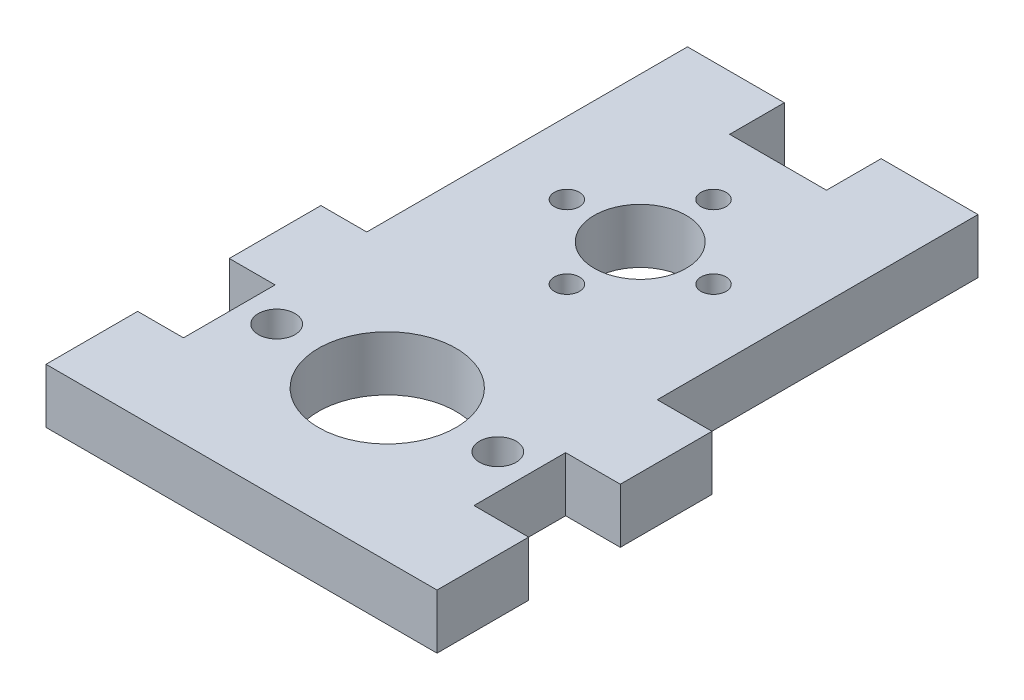
ISO-10303-21;
HEADER;
FILE_DESCRIPTION(('STEP AP214'),'2;1');
FILE_NAME('part.step','',(''),(''),'','','');
FILE_SCHEMA(('AUTOMOTIVE_DESIGN { 1 0 10303 214 1 1 1 1 }'));
ENDSEC;
DATA;
#1=APPLICATION_CONTEXT('core data for automotive mechanical design processes');
#2=APPLICATION_PROTOCOL_DEFINITION('international standard','automotive_design',2000,#1);
#3=PRODUCT_CONTEXT('',#1,'mechanical');
#4=PRODUCT('Part','Part','',(#3));
#5=PRODUCT_RELATED_PRODUCT_CATEGORY('part','',(#4));
#6=PRODUCT_DEFINITION_FORMATION('','',#4);
#7=PRODUCT_DEFINITION_CONTEXT('part definition',#1,'design');
#8=PRODUCT_DEFINITION('design','',#6,#7);
#9=PRODUCT_DEFINITION_SHAPE('','',#8);
#10=(LENGTH_UNIT() NAMED_UNIT(*) SI_UNIT(.MILLI.,.METRE.));
#11=(NAMED_UNIT(*) PLANE_ANGLE_UNIT() SI_UNIT($,.RADIAN.));
#12=(NAMED_UNIT(*) SI_UNIT($,.STERADIAN.) SOLID_ANGLE_UNIT());
#13=UNCERTAINTY_MEASURE_WITH_UNIT(LENGTH_MEASURE(1.E-05),#10,'distance_accuracy_value','');
#14=(GEOMETRIC_REPRESENTATION_CONTEXT(3) GLOBAL_UNCERTAINTY_ASSIGNED_CONTEXT((#13)) GLOBAL_UNIT_ASSIGNED_CONTEXT((#10,
#11,#12)) REPRESENTATION_CONTEXT('',''));
#15=CARTESIAN_POINT('',(0.,0.,0.));
#16=DIRECTION('',(0.,0.,1.));
#17=DIRECTION('',(1.,0.,0.));
#18=AXIS2_PLACEMENT_3D('',#15,#16,#17);
#19=CARTESIAN_POINT('',(31.7,5.969,0.));
#20=DIRECTION('',(-1.,0.,0.));
#21=DIRECTION('',(0.,0.,1.));
#22=AXIS2_PLACEMENT_3D('',#19,#20,#21);
#23=PLANE('',#22);
#24=DIRECTION('',(0.,1.,0.));
#25=VECTOR('',#24,1.);
#26=CARTESIAN_POINT('',(31.7,0.,-30.));
#27=LINE('',#26,#25);
#28=CARTESIAN_POINT('',(31.7,0.,-30.));
#29=VERTEX_POINT('',#28);
#30=CARTESIAN_POINT('',(31.7,5.969,-30.));
#31=VERTEX_POINT('',#30);
#32=EDGE_CURVE('E231',#29,#31,#27,.T.);
#33=ORIENTED_EDGE('',*,*,#32,.F.);
#34=DIRECTION('',(0.,0.,-1.));
#35=VECTOR('',#34,1.);
#36=CARTESIAN_POINT('',(31.7,0.,0.));
#37=LINE('',#36,#35);
#38=CARTESIAN_POINT('',(31.7,0.,-65.));
#39=VERTEX_POINT('',#38);
#40=EDGE_CURVE('E186',#29,#39,#37,.T.);
#41=ORIENTED_EDGE('',*,*,#40,.T.);
#42=DIRECTION('',(0.,-1.,0.));
#43=VECTOR('',#42,1.);
#44=CARTESIAN_POINT('',(31.7,5.969,-65.));
#45=LINE('',#44,#43);
#46=CARTESIAN_POINT('',(31.7,5.969,-65.));
#47=VERTEX_POINT('',#46);
#48=EDGE_CURVE('E11',#47,#39,#45,.T.);
#49=ORIENTED_EDGE('',*,*,#48,.F.);
#50=DIRECTION('',(0.,0.,-1.));
#51=VECTOR('',#50,1.);
#52=CARTESIAN_POINT('',(31.7,5.969,0.));
#53=LINE('',#52,#51);
#54=EDGE_CURVE('E301',#31,#47,#53,.T.);
#55=ORIENTED_EDGE('',*,*,#54,.F.);
#56=EDGE_LOOP('',(#33,#41,#49,#55));
#57=FACE_BOUND('',#56,.T.);
#58=ADVANCED_FACE('F37',(#57),#23,.F.);
#59=CARTESIAN_POINT('',(0.,5.969,0.));
#60=DIRECTION('',(1.,0.,0.));
#61=DIRECTION('',(0.,0.,-1.));
#62=AXIS2_PLACEMENT_3D('',#59,#60,#61);
#63=PLANE('',#62);
#64=DIRECTION('',(0.,0.,1.));
#65=VECTOR('',#64,1.);
#66=CARTESIAN_POINT('',(0.,5.969,0.));
#67=LINE('',#66,#65);
#68=CARTESIAN_POINT('',(0.,5.969,-20.));
#69=VERTEX_POINT('',#68);
#70=CARTESIAN_POINT('',(0.,5.969,-10.));
#71=VERTEX_POINT('',#70);
#72=EDGE_CURVE('E299',#69,#71,#67,.T.);
#73=ORIENTED_EDGE('',*,*,#72,.F.);
#74=DIRECTION('',(0.,1.,0.));
#75=VECTOR('',#74,1.);
#76=CARTESIAN_POINT('',(0.,0.,-20.));
#77=LINE('',#76,#75);
#78=CARTESIAN_POINT('',(0.,0.,-20.));
#79=VERTEX_POINT('',#78);
#80=EDGE_CURVE('E256',#79,#69,#77,.T.);
#81=ORIENTED_EDGE('',*,*,#80,.F.);
#82=DIRECTION('',(0.,0.,1.));
#83=VECTOR('',#82,1.);
#84=CARTESIAN_POINT('',(0.,0.,0.));
#85=LINE('',#84,#83);
#86=CARTESIAN_POINT('',(0.,0.,-10.));
#87=VERTEX_POINT('',#86);
#88=EDGE_CURVE('E292',#79,#87,#85,.T.);
#89=ORIENTED_EDGE('',*,*,#88,.T.);
#90=DIRECTION('',(0.,1.,0.));
#91=VECTOR('',#90,1.);
#92=CARTESIAN_POINT('',(0.,0.,-10.));
#93=LINE('',#92,#91);
#94=EDGE_CURVE('E272',#87,#71,#93,.T.);
#95=ORIENTED_EDGE('',*,*,#94,.T.);
#96=EDGE_LOOP('',(#73,#81,#89,#95));
#97=FACE_BOUND('',#96,.T.);
#98=ADVANCED_FACE('F397',(#97),#63,.F.);
#99=CARTESIAN_POINT('',(0.,5.969,0.));
#100=DIRECTION('',(0.,-1.,0.));
#101=DIRECTION('',(0.,0.,-1.));
#102=AXIS2_PLACEMENT_3D('',#99,#100,#101);
#103=PLANE('',#102);
#104=CARTESIAN_POINT('',(23.85,5.969,-43.99));
#105=DIRECTION('',(0.,-1.,0.));
#106=DIRECTION('',(0.,0.,-1.));
#107=AXIS2_PLACEMENT_3D('',#104,#105,#106);
#108=CIRCLE('',#107,1.37);
#109=CARTESIAN_POINT('',(23.85,5.969,-45.36));
#110=VERTEX_POINT('',#109);
#111=EDGE_CURVE('E503',#110,#110,#108,.T.);
#112=ORIENTED_EDGE('',*,*,#111,.T.);
#113=EDGE_LOOP('',(#112));
#114=FACE_BOUND('',#113,.T.);
#115=CARTESIAN_POINT('',(15.85,5.969,-51.99));
#116=DIRECTION('',(0.,-1.,0.));
#117=DIRECTION('',(0.,0.,-1.));
#118=AXIS2_PLACEMENT_3D('',#115,#116,#117);
#119=CIRCLE('',#118,1.37);
#120=CARTESIAN_POINT('',(15.85,5.969,-53.36));
#121=VERTEX_POINT('',#120);
#122=EDGE_CURVE('E506',#121,#121,#119,.T.);
#123=ORIENTED_EDGE('',*,*,#122,.T.);
#124=EDGE_LOOP('',(#123));
#125=FACE_BOUND('',#124,.T.);
#126=CARTESIAN_POINT('',(15.85,5.969,-35.99));
#127=DIRECTION('',(0.,-1.,0.));
#128=DIRECTION('',(0.,0.,-1.));
#129=AXIS2_PLACEMENT_3D('',#126,#127,#128);
#130=CIRCLE('',#129,1.37);
#131=CARTESIAN_POINT('',(15.85,5.969,-37.36));
#132=VERTEX_POINT('',#131);
#133=EDGE_CURVE('E515',#132,#132,#130,.T.);
#134=ORIENTED_EDGE('',*,*,#133,.T.);
#135=EDGE_LOOP('',(#134));
#136=FACE_BOUND('',#135,.T.);
#137=CARTESIAN_POINT('',(7.85,5.969,-43.99));
#138=DIRECTION('',(0.,-1.,0.));
#139=DIRECTION('',(0.,0.,-1.));
#140=AXIS2_PLACEMENT_3D('',#137,#138,#139);
#141=CIRCLE('',#140,1.37);
#142=CARTESIAN_POINT('',(7.85,5.969,-45.36));
#143=VERTEX_POINT('',#142);
#144=EDGE_CURVE('E521',#143,#143,#141,.T.);
#145=ORIENTED_EDGE('',*,*,#144,.T.);
#146=EDGE_LOOP('',(#145));
#147=FACE_BOUND('',#146,.T.);
#148=CARTESIAN_POINT('',(27.915,5.969,-16.3861));
#149=DIRECTION('',(0.,-1.,0.));
#150=DIRECTION('',(0.,0.,-1.));
#151=AXIS2_PLACEMENT_3D('',#148,#149,#150);
#152=CIRCLE('',#151,2.);
#153=CARTESIAN_POINT('',(27.915,5.969,-18.3861));
#154=VERTEX_POINT('',#153);
#155=EDGE_CURVE('E209',#154,#154,#152,.T.);
#156=ORIENTED_EDGE('',*,*,#155,.T.);
#157=EDGE_LOOP('',(#156));
#158=FACE_BOUND('',#157,.T.);
#159=CARTESIAN_POINT('',(3.785,5.969,-16.3861));
#160=DIRECTION('',(0.,-1.,0.));
#161=DIRECTION('',(0.,0.,-1.));
#162=AXIS2_PLACEMENT_3D('',#159,#160,#161);
#163=CIRCLE('',#162,2.);
#164=CARTESIAN_POINT('',(3.785,5.969,-18.3861));
#165=VERTEX_POINT('',#164);
#166=EDGE_CURVE('E531',#165,#165,#163,.T.);
#167=ORIENTED_EDGE('',*,*,#166,.T.);
#168=EDGE_LOOP('',(#167));
#169=FACE_BOUND('',#168,.T.);
#170=CARTESIAN_POINT('',(0.,5.969,-65.));
#171=VERTEX_POINT('',#170);
#172=CARTESIAN_POINT('',(0.,5.969,-30.));
#173=VERTEX_POINT('',#172);
#174=EDGE_CURVE('E295',#171,#173,#67,.T.);
#175=ORIENTED_EDGE('',*,*,#174,.T.);
#176=DIRECTION('',(-1.,0.,0.));
#177=VECTOR('',#176,1.);
#178=CARTESIAN_POINT('',(0.,5.969,-30.));
#179=LINE('',#178,#177);
#180=CARTESIAN_POINT('',(-5.,5.969,-30.));
#181=VERTEX_POINT('',#180);
#182=EDGE_CURVE('E233',#173,#181,#179,.T.);
#183=ORIENTED_EDGE('',*,*,#182,.T.);
#184=DIRECTION('',(0.,0.,1.));
#185=VECTOR('',#184,1.);
#186=CARTESIAN_POINT('',(-5.,5.969,-20.));
#187=LINE('',#186,#185);
#188=CARTESIAN_POINT('',(-5.,5.969,-20.));
#189=VERTEX_POINT('',#188);
#190=EDGE_CURVE('E252',#181,#189,#187,.T.);
#191=ORIENTED_EDGE('',*,*,#190,.T.);
#192=DIRECTION('',(1.,0.,0.));
#193=VECTOR('',#192,1.);
#194=CARTESIAN_POINT('',(0.,5.969,-20.));
#195=LINE('',#194,#193);
#196=EDGE_CURVE('E244',#189,#69,#195,.T.);
#197=ORIENTED_EDGE('',*,*,#196,.T.);
#198=ORIENTED_EDGE('',*,*,#72,.T.);
#199=DIRECTION('',(-1.,0.,0.));
#200=VECTOR('',#199,1.);
#201=CARTESIAN_POINT('',(0.,5.969,-10.));
#202=LINE('',#201,#200);
#203=CARTESIAN_POINT('',(-5.,5.969,-10.));
#204=VERTEX_POINT('',#203);
#205=EDGE_CURVE('E259',#71,#204,#202,.T.);
#206=ORIENTED_EDGE('',*,*,#205,.T.);
#207=DIRECTION('',(0.,0.,1.));
#208=VECTOR('',#207,1.);
#209=CARTESIAN_POINT('',(-5.,5.969,0.));
#210=LINE('',#209,#208);
#211=CARTESIAN_POINT('',(-5.,5.969,0.));
#212=VERTEX_POINT('',#211);
#213=EDGE_CURVE('E270',#204,#212,#210,.T.);
#214=ORIENTED_EDGE('',*,*,#213,.T.);
#215=DIRECTION('',(1.,0.,0.));
#216=VECTOR('',#215,1.);
#217=CARTESIAN_POINT('',(0.,5.969,0.));
#218=LINE('',#217,#216);
#219=CARTESIAN_POINT('',(37.669,5.969,0.));
#220=VERTEX_POINT('',#219);
#221=EDGE_CURVE('E298',#212,#220,#218,.T.);
#222=ORIENTED_EDGE('',*,*,#221,.T.);
#223=DIRECTION('',(0.,0.,-1.));
#224=VECTOR('',#223,1.);
#225=CARTESIAN_POINT('',(37.669,5.969,0.));
#226=LINE('',#225,#224);
#227=CARTESIAN_POINT('',(37.669,5.969,-10.));
#228=VERTEX_POINT('',#227);
#229=EDGE_CURVE('E193',#220,#228,#226,.T.);
#230=ORIENTED_EDGE('',*,*,#229,.T.);
#231=DIRECTION('',(-1.,0.,0.));
#232=VECTOR('',#231,1.);
#233=CARTESIAN_POINT('',(31.7,5.969,-10.));
#234=LINE('',#233,#232);
#235=CARTESIAN_POINT('',(31.7,5.969,-10.));
#236=VERTEX_POINT('',#235);
#237=EDGE_CURVE('E52',#228,#236,#234,.T.);
#238=ORIENTED_EDGE('',*,*,#237,.T.);
#239=CARTESIAN_POINT('',(31.7,5.969,-20.));
#240=VERTEX_POINT('',#239);
#241=EDGE_CURVE('E57',#236,#240,#53,.T.);
#242=ORIENTED_EDGE('',*,*,#241,.T.);
#243=DIRECTION('',(1.,0.,0.));
#244=VECTOR('',#243,1.);
#245=CARTESIAN_POINT('',(31.7,5.969,-20.));
#246=LINE('',#245,#244);
#247=CARTESIAN_POINT('',(37.669,5.969,-20.));
#248=VERTEX_POINT('',#247);
#249=EDGE_CURVE('E213',#240,#248,#246,.T.);
#250=ORIENTED_EDGE('',*,*,#249,.T.);
#251=DIRECTION('',(0.,0.,-1.));
#252=VECTOR('',#251,1.);
#253=CARTESIAN_POINT('',(37.669,5.969,-20.));
#254=LINE('',#253,#252);
#255=CARTESIAN_POINT('',(37.669,5.969,-30.));
#256=VERTEX_POINT('',#255);
#257=EDGE_CURVE('E226',#248,#256,#254,.T.);
#258=ORIENTED_EDGE('',*,*,#257,.T.);
#259=DIRECTION('',(-1.,0.,0.));
#260=VECTOR('',#259,1.);
#261=CARTESIAN_POINT('',(31.7,5.969,-30.));
#262=LINE('',#261,#260);
#263=EDGE_CURVE('E219',#256,#31,#262,.T.);
#264=ORIENTED_EDGE('',*,*,#263,.T.);
#265=ORIENTED_EDGE('',*,*,#54,.T.);
#266=DIRECTION('',(-1.,0.,0.));
#267=VECTOR('',#266,1.);
#268=CARTESIAN_POINT('',(21.1333333333333,5.969,-65.));
#269=LINE('',#268,#267);
#270=CARTESIAN_POINT('',(21.1333333333333,5.969,-65.));
#271=VERTEX_POINT('',#270);
#272=EDGE_CURVE('E303',#47,#271,#269,.T.);
#273=ORIENTED_EDGE('',*,*,#272,.T.);
#274=DIRECTION('',(0.,0.,1.));
#275=VECTOR('',#274,1.);
#276=CARTESIAN_POINT('',(21.1333333333333,5.969,-65.));
#277=LINE('',#276,#275);
#278=CARTESIAN_POINT('',(21.1333333333333,5.969,-59.031));
#279=VERTEX_POINT('',#278);
#280=EDGE_CURVE('E305',#271,#279,#277,.T.);
#281=ORIENTED_EDGE('',*,*,#280,.T.);
#282=DIRECTION('',(-1.,0.,0.));
#283=VECTOR('',#282,1.);
#284=CARTESIAN_POINT('',(21.1333333333333,5.969,-59.031));
#285=LINE('',#284,#283);
#286=CARTESIAN_POINT('',(10.5666666666667,5.969,-59.031));
#287=VERTEX_POINT('',#286);
#288=EDGE_CURVE('E307',#279,#287,#285,.T.);
#289=ORIENTED_EDGE('',*,*,#288,.T.);
#290=DIRECTION('',(0.,0.,-1.));
#291=VECTOR('',#290,1.);
#292=CARTESIAN_POINT('',(10.5666666666667,5.969,-65.));
#293=LINE('',#292,#291);
#294=CARTESIAN_POINT('',(10.5666666666667,5.969,-65.));
#295=VERTEX_POINT('',#294);
#296=EDGE_CURVE('E309',#287,#295,#293,.T.);
#297=ORIENTED_EDGE('',*,*,#296,.T.);
#298=DIRECTION('',(-1.,0.,0.));
#299=VECTOR('',#298,1.);
#300=CARTESIAN_POINT('',(0.,5.969,-65.));
#301=LINE('',#300,#299);
#302=EDGE_CURVE('E311',#295,#171,#301,.T.);
#303=ORIENTED_EDGE('',*,*,#302,.T.);
#304=EDGE_LOOP('',(#175,#183,#191,#197,#198,#206,#214,#222,#230,#238,#242,#250,#258,#264,#265,
#273,#281,#289,#297,#303));
#305=FACE_BOUND('',#304,.T.);
#306=CARTESIAN_POINT('',(15.85,5.969,-43.99));
#307=DIRECTION('',(0.,1.,0.));
#308=DIRECTION('',(0.,0.,1.));
#309=AXIS2_PLACEMENT_3D('',#306,#307,#308);
#310=CIRCLE('',#309,5.015);
#311=CARTESIAN_POINT('',(15.85,5.969,-38.975));
#312=VERTEX_POINT('',#311);
#313=EDGE_CURVE('E289',#312,#312,#310,.T.);
#314=ORIENTED_EDGE('',*,*,#313,.F.);
#315=EDGE_LOOP('',(#314));
#316=FACE_BOUND('',#315,.T.);
#317=CARTESIAN_POINT('',(15.85,5.969,-16.3861));
#318=DIRECTION('',(0.,1.,0.));
#319=DIRECTION('',(0.,0.,1.));
#320=AXIS2_PLACEMENT_3D('',#317,#318,#319);
#321=CIRCLE('',#320,7.5);
#322=CARTESIAN_POINT('',(15.85,5.969,-8.8861));
#323=VERTEX_POINT('',#322);
#324=EDGE_CURVE('E283',#323,#323,#321,.T.);
#325=ORIENTED_EDGE('',*,*,#324,.F.);
#326=EDGE_LOOP('',(#325));
#327=FACE_BOUND('',#326,.T.);
#328=ADVANCED_FACE('F361',(#114,#125,#136,#147,#158,#169,#305,#316,#327),#103,.F.);
#329=CARTESIAN_POINT('',(0.,0.,0.));
#330=DIRECTION('',(0.,-1.,0.));
#331=DIRECTION('',(0.,0.,-1.));
#332=AXIS2_PLACEMENT_3D('',#329,#330,#331);
#333=PLANE('',#332);
#334=CARTESIAN_POINT('',(23.85,0.,-43.99));
#335=DIRECTION('',(0.,-1.,0.));
#336=DIRECTION('',(0.,0.,-1.));
#337=AXIS2_PLACEMENT_3D('',#334,#335,#336);
#338=CIRCLE('',#337,1.37);
#339=CARTESIAN_POINT('',(23.85,0.,-45.36));
#340=VERTEX_POINT('',#339);
#341=EDGE_CURVE('E505',#340,#340,#338,.T.);
#342=ORIENTED_EDGE('',*,*,#341,.F.);
#343=EDGE_LOOP('',(#342));
#344=FACE_BOUND('',#343,.T.);
#345=CARTESIAN_POINT('',(15.85,0.,-51.99));
#346=DIRECTION('',(0.,-1.,0.));
#347=DIRECTION('',(0.,0.,-1.));
#348=AXIS2_PLACEMENT_3D('',#345,#346,#347);
#349=CIRCLE('',#348,1.37);
#350=CARTESIAN_POINT('',(15.85,0.,-53.36));
#351=VERTEX_POINT('',#350);
#352=EDGE_CURVE('E510',#351,#351,#349,.T.);
#353=ORIENTED_EDGE('',*,*,#352,.F.);
#354=EDGE_LOOP('',(#353));
#355=FACE_BOUND('',#354,.T.);
#356=CARTESIAN_POINT('',(15.85,0.,-35.99));
#357=DIRECTION('',(0.,-1.,0.));
#358=DIRECTION('',(0.,0.,-1.));
#359=AXIS2_PLACEMENT_3D('',#356,#357,#358);
#360=CIRCLE('',#359,1.37);
#361=CARTESIAN_POINT('',(15.85,0.,-37.36));
#362=VERTEX_POINT('',#361);
#363=EDGE_CURVE('E518',#362,#362,#360,.T.);
#364=ORIENTED_EDGE('',*,*,#363,.F.);
#365=EDGE_LOOP('',(#364));
#366=FACE_BOUND('',#365,.T.);
#367=CARTESIAN_POINT('',(7.85,0.,-43.99));
#368=DIRECTION('',(0.,-1.,0.));
#369=DIRECTION('',(0.,0.,-1.));
#370=AXIS2_PLACEMENT_3D('',#367,#368,#369);
#371=CIRCLE('',#370,1.37);
#372=CARTESIAN_POINT('',(7.85,0.,-45.36));
#373=VERTEX_POINT('',#372);
#374=EDGE_CURVE('E524',#373,#373,#371,.T.);
#375=ORIENTED_EDGE('',*,*,#374,.F.);
#376=EDGE_LOOP('',(#375));
#377=FACE_BOUND('',#376,.T.);
#378=CARTESIAN_POINT('',(27.915,0.,-16.3861));
#379=DIRECTION('',(0.,-1.,0.));
#380=DIRECTION('',(0.,0.,-1.));
#381=AXIS2_PLACEMENT_3D('',#378,#379,#380);
#382=CIRCLE('',#381,2.);
#383=CARTESIAN_POINT('',(27.915,0.,-18.3861));
#384=VERTEX_POINT('',#383);
#385=EDGE_CURVE('E529',#384,#384,#382,.T.);
#386=ORIENTED_EDGE('',*,*,#385,.F.);
#387=EDGE_LOOP('',(#386));
#388=FACE_BOUND('',#387,.T.);
#389=CARTESIAN_POINT('',(3.785,0.,-16.3861));
#390=DIRECTION('',(0.,-1.,0.));
#391=DIRECTION('',(0.,0.,-1.));
#392=AXIS2_PLACEMENT_3D('',#389,#390,#391);
#393=CIRCLE('',#392,2.);
#394=CARTESIAN_POINT('',(3.785,0.,-18.3861));
#395=VERTEX_POINT('',#394);
#396=EDGE_CURVE('E206',#395,#395,#393,.T.);
#397=ORIENTED_EDGE('',*,*,#396,.F.);
#398=EDGE_LOOP('',(#397));
#399=FACE_BOUND('',#398,.T.);
#400=CARTESIAN_POINT('',(15.85,0.,-43.99));
#401=DIRECTION('',(0.,1.,0.));
#402=DIRECTION('',(0.,0.,1.));
#403=AXIS2_PLACEMENT_3D('',#400,#401,#402);
#404=CIRCLE('',#403,5.015);
#405=CARTESIAN_POINT('',(15.85,0.,-38.975));
#406=VERTEX_POINT('',#405);
#407=EDGE_CURVE('E286',#406,#406,#404,.T.);
#408=ORIENTED_EDGE('',*,*,#407,.T.);
#409=EDGE_LOOP('',(#408));
#410=FACE_BOUND('',#409,.T.);
#411=CARTESIAN_POINT('',(0.,0.,-65.));
#412=VERTEX_POINT('',#411);
#413=CARTESIAN_POINT('',(0.,0.,-30.));
#414=VERTEX_POINT('',#413);
#415=EDGE_CURVE('E187',#412,#414,#85,.T.);
#416=ORIENTED_EDGE('',*,*,#415,.F.);
#417=DIRECTION('',(-1.,0.,0.));
#418=VECTOR('',#417,1.);
#419=CARTESIAN_POINT('',(0.,0.,-65.));
#420=LINE('',#419,#418);
#421=CARTESIAN_POINT('',(10.5666666666667,0.,-65.));
#422=VERTEX_POINT('',#421);
#423=EDGE_CURVE('E326',#422,#412,#420,.T.);
#424=ORIENTED_EDGE('',*,*,#423,.F.);
#425=DIRECTION('',(0.,0.,-1.));
#426=VECTOR('',#425,1.);
#427=CARTESIAN_POINT('',(10.5666666666667,0.,-65.));
#428=LINE('',#427,#426);
#429=CARTESIAN_POINT('',(10.5666666666667,0.,-59.031));
#430=VERTEX_POINT('',#429);
#431=EDGE_CURVE('E324',#430,#422,#428,.T.);
#432=ORIENTED_EDGE('',*,*,#431,.F.);
#433=DIRECTION('',(-1.,0.,0.));
#434=VECTOR('',#433,1.);
#435=CARTESIAN_POINT('',(21.1333333333333,0.,-59.031));
#436=LINE('',#435,#434);
#437=CARTESIAN_POINT('',(21.1333333333333,0.,-59.031));
#438=VERTEX_POINT('',#437);
#439=EDGE_CURVE('E322',#438,#430,#436,.T.);
#440=ORIENTED_EDGE('',*,*,#439,.F.);
#441=DIRECTION('',(0.,0.,1.));
#442=VECTOR('',#441,1.);
#443=CARTESIAN_POINT('',(21.1333333333333,0.,-65.));
#444=LINE('',#443,#442);
#445=CARTESIAN_POINT('',(21.1333333333333,0.,-65.));
#446=VERTEX_POINT('',#445);
#447=EDGE_CURVE('E320',#446,#438,#444,.T.);
#448=ORIENTED_EDGE('',*,*,#447,.F.);
#449=DIRECTION('',(-1.,0.,0.));
#450=VECTOR('',#449,1.);
#451=CARTESIAN_POINT('',(21.1333333333333,0.,-65.));
#452=LINE('',#451,#450);
#453=EDGE_CURVE('E318',#39,#446,#452,.T.);
#454=ORIENTED_EDGE('',*,*,#453,.F.);
#455=ORIENTED_EDGE('',*,*,#40,.F.);
#456=DIRECTION('',(-1.,0.,0.));
#457=VECTOR('',#456,1.);
#458=CARTESIAN_POINT('',(31.7,0.,-30.));
#459=LINE('',#458,#457);
#460=CARTESIAN_POINT('',(37.669,0.,-30.));
#461=VERTEX_POINT('',#460);
#462=EDGE_CURVE('E222',#461,#29,#459,.T.);
#463=ORIENTED_EDGE('',*,*,#462,.F.);
#464=DIRECTION('',(0.,0.,-1.));
#465=VECTOR('',#464,1.);
#466=CARTESIAN_POINT('',(37.669,0.,-20.));
#467=LINE('',#466,#465);
#468=CARTESIAN_POINT('',(37.669,0.,-20.));
#469=VERTEX_POINT('',#468);
#470=EDGE_CURVE('E218',#469,#461,#467,.T.);
#471=ORIENTED_EDGE('',*,*,#470,.F.);
#472=DIRECTION('',(1.,0.,0.));
#473=VECTOR('',#472,1.);
#474=CARTESIAN_POINT('',(31.7,0.,-20.));
#475=LINE('',#474,#473);
#476=CARTESIAN_POINT('',(31.7,0.,-20.));
#477=VERTEX_POINT('',#476);
#478=EDGE_CURVE('E215',#477,#469,#475,.T.);
#479=ORIENTED_EDGE('',*,*,#478,.F.);
#480=CARTESIAN_POINT('',(31.7,0.,-10.));
#481=VERTEX_POINT('',#480);
#482=EDGE_CURVE('E316',#481,#477,#37,.T.);
#483=ORIENTED_EDGE('',*,*,#482,.F.);
#484=DIRECTION('',(-1.,0.,0.));
#485=VECTOR('',#484,1.);
#486=CARTESIAN_POINT('',(31.7,0.,-10.));
#487=LINE('',#486,#485);
#488=CARTESIAN_POINT('',(37.669,0.,-10.));
#489=VERTEX_POINT('',#488);
#490=EDGE_CURVE('E195',#489,#481,#487,.T.);
#491=ORIENTED_EDGE('',*,*,#490,.F.);
#492=DIRECTION('',(0.,0.,-1.));
#493=VECTOR('',#492,1.);
#494=CARTESIAN_POINT('',(37.669,0.,0.));
#495=LINE('',#494,#493);
#496=CARTESIAN_POINT('',(37.669,0.,0.));
#497=VERTEX_POINT('',#496);
#498=EDGE_CURVE('E192',#497,#489,#495,.T.);
#499=ORIENTED_EDGE('',*,*,#498,.F.);
#500=DIRECTION('',(1.,0.,0.));
#501=VECTOR('',#500,1.);
#502=CARTESIAN_POINT('',(0.,0.,0.));
#503=LINE('',#502,#501);
#504=CARTESIAN_POINT('',(-5.,0.,0.));
#505=VERTEX_POINT('',#504);
#506=EDGE_CURVE('E175',#505,#497,#503,.T.);
#507=ORIENTED_EDGE('',*,*,#506,.F.);
#508=DIRECTION('',(0.,0.,1.));
#509=VECTOR('',#508,1.);
#510=CARTESIAN_POINT('',(-5.,0.,0.));
#511=LINE('',#510,#509);
#512=CARTESIAN_POINT('',(-5.,0.,-10.));
#513=VERTEX_POINT('',#512);
#514=EDGE_CURVE('E269',#513,#505,#511,.T.);
#515=ORIENTED_EDGE('',*,*,#514,.F.);
#516=DIRECTION('',(-1.,0.,0.));
#517=VECTOR('',#516,1.);
#518=CARTESIAN_POINT('',(0.,0.,-10.));
#519=LINE('',#518,#517);
#520=EDGE_CURVE('E266',#87,#513,#519,.T.);
#521=ORIENTED_EDGE('',*,*,#520,.F.);
#522=ORIENTED_EDGE('',*,*,#88,.F.);
#523=DIRECTION('',(1.,0.,0.));
#524=VECTOR('',#523,1.);
#525=CARTESIAN_POINT('',(0.,0.,-20.));
#526=LINE('',#525,#524);
#527=CARTESIAN_POINT('',(-5.,0.,-20.));
#528=VERTEX_POINT('',#527);
#529=EDGE_CURVE('E247',#528,#79,#526,.T.);
#530=ORIENTED_EDGE('',*,*,#529,.F.);
#531=DIRECTION('',(0.,0.,1.));
#532=VECTOR('',#531,1.);
#533=CARTESIAN_POINT('',(-5.,0.,-20.));
#534=LINE('',#533,#532);
#535=CARTESIAN_POINT('',(-5.,0.,-30.));
#536=VERTEX_POINT('',#535);
#537=EDGE_CURVE('E243',#536,#528,#534,.T.);
#538=ORIENTED_EDGE('',*,*,#537,.F.);
#539=DIRECTION('',(-1.,0.,0.));
#540=VECTOR('',#539,1.);
#541=CARTESIAN_POINT('',(0.,0.,-30.));
#542=LINE('',#541,#540);
#543=EDGE_CURVE('E240',#414,#536,#542,.T.);
#544=ORIENTED_EDGE('',*,*,#543,.F.);
#545=EDGE_LOOP('',(#416,#424,#432,#440,#448,#454,#455,#463,#471,#479,#483,#491,#499,#507,#515,
#521,#522,#530,#538,#544));
#546=FACE_BOUND('',#545,.T.);
#547=CARTESIAN_POINT('',(15.85,0.,-16.3861));
#548=DIRECTION('',(0.,1.,0.));
#549=DIRECTION('',(0.,0.,1.));
#550=AXIS2_PLACEMENT_3D('',#547,#548,#549);
#551=CIRCLE('',#550,7.5);
#552=CARTESIAN_POINT('',(15.85,0.,-8.8861));
#553=VERTEX_POINT('',#552);
#554=EDGE_CURVE('E278',#553,#553,#551,.T.);
#555=ORIENTED_EDGE('',*,*,#554,.T.);
#556=EDGE_LOOP('',(#555));
#557=FACE_BOUND('',#556,.T.);
#558=ADVANCED_FACE('F199',(#344,#355,#366,#377,#388,#399,#410,#546,#557),#333,.T.);
#559=ORIENTED_EDGE('',*,*,#415,.T.);
#560=DIRECTION('',(0.,1.,0.));
#561=VECTOR('',#560,1.);
#562=CARTESIAN_POINT('',(0.,0.,-30.));
#563=LINE('',#562,#561);
#564=EDGE_CURVE('E249',#414,#173,#563,.T.);
#565=ORIENTED_EDGE('',*,*,#564,.T.);
#566=ORIENTED_EDGE('',*,*,#174,.F.);
#567=DIRECTION('',(0.,-1.,0.));
#568=VECTOR('',#567,1.);
#569=CARTESIAN_POINT('',(0.,5.969,-65.));
#570=LINE('',#569,#568);
#571=EDGE_CURVE('E313',#171,#412,#570,.T.);
#572=ORIENTED_EDGE('',*,*,#571,.T.);
#573=EDGE_LOOP('',(#559,#565,#566,#572));
#574=FACE_BOUND('',#573,.T.);
#575=ADVANCED_FACE('F39',(#574),#63,.F.);
#576=CARTESIAN_POINT('',(0.,5.969,0.));
#577=DIRECTION('',(0.,0.,-1.));
#578=DIRECTION('',(-1.,0.,0.));
#579=AXIS2_PLACEMENT_3D('',#576,#577,#578);
#580=PLANE('',#579);
#581=ORIENTED_EDGE('',*,*,#506,.T.);
#582=DIRECTION('',(0.,1.,0.));
#583=VECTOR('',#582,1.);
#584=CARTESIAN_POINT('',(37.669,0.,0.));
#585=LINE('',#584,#583);
#586=EDGE_CURVE('E178',#497,#220,#585,.T.);
#587=ORIENTED_EDGE('',*,*,#586,.T.);
#588=ORIENTED_EDGE('',*,*,#221,.F.);
#589=DIRECTION('',(0.,1.,0.));
#590=VECTOR('',#589,1.);
#591=CARTESIAN_POINT('',(-5.,0.,0.));
#592=LINE('',#591,#590);
#593=EDGE_CURVE('E181',#505,#212,#592,.T.);
#594=ORIENTED_EDGE('',*,*,#593,.F.);
#595=EDGE_LOOP('',(#581,#587,#588,#594));
#596=FACE_BOUND('',#595,.T.);
#597=ADVANCED_FACE('F177',(#596),#580,.F.);
#598=ORIENTED_EDGE('',*,*,#241,.F.);
#599=DIRECTION('',(0.,1.,0.));
#600=VECTOR('',#599,1.);
#601=CARTESIAN_POINT('',(31.7,0.,-10.));
#602=LINE('',#601,#600);
#603=EDGE_CURVE('E211',#481,#236,#602,.T.);
#604=ORIENTED_EDGE('',*,*,#603,.F.);
#605=ORIENTED_EDGE('',*,*,#482,.T.);
#606=DIRECTION('',(0.,1.,0.));
#607=VECTOR('',#606,1.);
#608=CARTESIAN_POINT('',(31.7,0.,-20.));
#609=LINE('',#608,#607);
#610=EDGE_CURVE('E224',#477,#240,#609,.T.);
#611=ORIENTED_EDGE('',*,*,#610,.T.);
#612=EDGE_LOOP('',(#598,#604,#605,#611));
#613=FACE_BOUND('',#612,.T.);
#614=ADVANCED_FACE('F383',(#613),#23,.F.);
#615=CARTESIAN_POINT('',(21.1333333333333,5.969,-65.));
#616=DIRECTION('',(0.,0.,1.));
#617=DIRECTION('',(1.,0.,0.));
#618=AXIS2_PLACEMENT_3D('',#615,#616,#617);
#619=PLANE('',#618);
#620=ORIENTED_EDGE('',*,*,#453,.T.);
#621=DIRECTION('',(0.,-1.,0.));
#622=VECTOR('',#621,1.);
#623=CARTESIAN_POINT('',(21.1333333333333,5.969,-65.));
#624=LINE('',#623,#622);
#625=EDGE_CURVE('E45',#271,#446,#624,.T.);
#626=ORIENTED_EDGE('',*,*,#625,.F.);
#627=ORIENTED_EDGE('',*,*,#272,.F.);
#628=ORIENTED_EDGE('',*,*,#48,.T.);
#629=EDGE_LOOP('',(#620,#626,#627,#628));
#630=FACE_BOUND('',#629,.T.);
#631=ADVANCED_FACE('F366',(#630),#619,.F.);
#632=CARTESIAN_POINT('',(21.1333333333333,5.969,-65.));
#633=DIRECTION('',(1.,0.,0.));
#634=DIRECTION('',(0.,0.,-1.));
#635=AXIS2_PLACEMENT_3D('',#632,#633,#634);
#636=PLANE('',#635);
#637=ORIENTED_EDGE('',*,*,#447,.T.);
#638=DIRECTION('',(0.,-1.,0.));
#639=VECTOR('',#638,1.);
#640=CARTESIAN_POINT('',(21.1333333333333,5.969,-59.031));
#641=LINE('',#640,#639);
#642=EDGE_CURVE('E336',#279,#438,#641,.T.);
#643=ORIENTED_EDGE('',*,*,#642,.F.);
#644=ORIENTED_EDGE('',*,*,#280,.F.);
#645=ORIENTED_EDGE('',*,*,#625,.T.);
#646=EDGE_LOOP('',(#637,#643,#644,#645));
#647=FACE_BOUND('',#646,.T.);
#648=ADVANCED_FACE('F343',(#647),#636,.F.);
#649=CARTESIAN_POINT('',(21.1333333333333,5.969,-59.031));
#650=DIRECTION('',(0.,0.,1.));
#651=DIRECTION('',(1.,0.,0.));
#652=AXIS2_PLACEMENT_3D('',#649,#650,#651);
#653=PLANE('',#652);
#654=ORIENTED_EDGE('',*,*,#439,.T.);
#655=DIRECTION('',(0.,-1.,0.));
#656=VECTOR('',#655,1.);
#657=CARTESIAN_POINT('',(10.5666666666667,5.969,-59.031));
#658=LINE('',#657,#656);
#659=EDGE_CURVE('E333',#287,#430,#658,.T.);
#660=ORIENTED_EDGE('',*,*,#659,.F.);
#661=ORIENTED_EDGE('',*,*,#288,.F.);
#662=ORIENTED_EDGE('',*,*,#642,.T.);
#663=EDGE_LOOP('',(#654,#660,#661,#662));
#664=FACE_BOUND('',#663,.T.);
#665=ADVANCED_FACE('F354',(#664),#653,.F.);
#666=CARTESIAN_POINT('',(10.5666666666667,5.969,-65.));
#667=DIRECTION('',(-1.,0.,0.));
#668=DIRECTION('',(0.,0.,1.));
#669=AXIS2_PLACEMENT_3D('',#666,#667,#668);
#670=PLANE('',#669);
#671=ORIENTED_EDGE('',*,*,#431,.T.);
#672=DIRECTION('',(0.,-1.,0.));
#673=VECTOR('',#672,1.);
#674=CARTESIAN_POINT('',(10.5666666666667,5.969,-65.));
#675=LINE('',#674,#673);
#676=EDGE_CURVE('E330',#295,#422,#675,.T.);
#677=ORIENTED_EDGE('',*,*,#676,.F.);
#678=ORIENTED_EDGE('',*,*,#296,.F.);
#679=ORIENTED_EDGE('',*,*,#659,.T.);
#680=EDGE_LOOP('',(#671,#677,#678,#679));
#681=FACE_BOUND('',#680,.T.);
#682=ADVANCED_FACE('F358',(#681),#670,.F.);
#683=CARTESIAN_POINT('',(0.,5.969,-65.));
#684=DIRECTION('',(0.,0.,1.));
#685=DIRECTION('',(1.,0.,0.));
#686=AXIS2_PLACEMENT_3D('',#683,#684,#685);
#687=PLANE('',#686);
#688=ORIENTED_EDGE('',*,*,#423,.T.);
#689=ORIENTED_EDGE('',*,*,#571,.F.);
#690=ORIENTED_EDGE('',*,*,#302,.F.);
#691=ORIENTED_EDGE('',*,*,#676,.T.);
#692=EDGE_LOOP('',(#688,#689,#690,#691));
#693=FACE_BOUND('',#692,.T.);
#694=ADVANCED_FACE('F413',(#693),#687,.F.);
#695=CARTESIAN_POINT('',(15.85,5.969,-43.99));
#696=DIRECTION('',(0.,-1.,0.));
#697=DIRECTION('',(0.,0.,-1.));
#698=AXIS2_PLACEMENT_3D('',#695,#696,#697);
#699=CYLINDRICAL_SURFACE('',#698,5.015);
#700=ORIENTED_EDGE('',*,*,#313,.T.);
#701=EDGE_LOOP('',(#700));
#702=FACE_BOUND('',#701,.T.);
#703=ORIENTED_EDGE('',*,*,#407,.F.);
#704=EDGE_LOOP('',(#703));
#705=FACE_BOUND('',#704,.T.);
#706=ADVANCED_FACE('F415',(#702,#705),#699,.F.);
#707=CARTESIAN_POINT('',(15.85,5.969,-16.3861));
#708=DIRECTION('',(0.,-1.,0.));
#709=DIRECTION('',(0.,0.,-1.));
#710=AXIS2_PLACEMENT_3D('',#707,#708,#709);
#711=CYLINDRICAL_SURFACE('',#710,7.5);
#712=ORIENTED_EDGE('',*,*,#324,.T.);
#713=EDGE_LOOP('',(#712));
#714=FACE_BOUND('',#713,.T.);
#715=ORIENTED_EDGE('',*,*,#554,.F.);
#716=EDGE_LOOP('',(#715));
#717=FACE_BOUND('',#716,.T.);
#718=ADVANCED_FACE('F421',(#714,#717),#711,.F.);
#719=CARTESIAN_POINT('',(-5.,0.,0.));
#720=DIRECTION('',(-1.,0.,0.));
#721=DIRECTION('',(0.,0.,1.));
#722=AXIS2_PLACEMENT_3D('',#719,#720,#721);
#723=PLANE('',#722);
#724=ORIENTED_EDGE('',*,*,#213,.F.);
#725=DIRECTION('',(0.,1.,0.));
#726=VECTOR('',#725,1.);
#727=CARTESIAN_POINT('',(-5.,0.,-10.));
#728=LINE('',#727,#726);
#729=EDGE_CURVE('E279',#513,#204,#728,.T.);
#730=ORIENTED_EDGE('',*,*,#729,.F.);
#731=ORIENTED_EDGE('',*,*,#514,.T.);
#732=ORIENTED_EDGE('',*,*,#593,.T.);
#733=EDGE_LOOP('',(#724,#730,#731,#732));
#734=FACE_BOUND('',#733,.T.);
#735=ADVANCED_FACE('F388',(#734),#723,.T.);
#736=CARTESIAN_POINT('',(0.,0.,-10.));
#737=DIRECTION('',(0.,0.,-1.));
#738=DIRECTION('',(-1.,0.,0.));
#739=AXIS2_PLACEMENT_3D('',#736,#737,#738);
#740=PLANE('',#739);
#741=ORIENTED_EDGE('',*,*,#205,.F.);
#742=ORIENTED_EDGE('',*,*,#94,.F.);
#743=ORIENTED_EDGE('',*,*,#520,.T.);
#744=ORIENTED_EDGE('',*,*,#729,.T.);
#745=EDGE_LOOP('',(#741,#742,#743,#744));
#746=FACE_BOUND('',#745,.T.);
#747=ADVANCED_FACE('F394',(#746),#740,.T.);
#748=CARTESIAN_POINT('',(0.,0.,-20.));
#749=DIRECTION('',(0.,0.,1.));
#750=DIRECTION('',(1.,0.,0.));
#751=AXIS2_PLACEMENT_3D('',#748,#749,#750);
#752=PLANE('',#751);
#753=ORIENTED_EDGE('',*,*,#196,.F.);
#754=DIRECTION('',(0.,1.,0.));
#755=VECTOR('',#754,1.);
#756=CARTESIAN_POINT('',(-5.,0.,-20.));
#757=LINE('',#756,#755);
#758=EDGE_CURVE('E260',#528,#189,#757,.T.);
#759=ORIENTED_EDGE('',*,*,#758,.F.);
#760=ORIENTED_EDGE('',*,*,#529,.T.);
#761=ORIENTED_EDGE('',*,*,#80,.T.);
#762=EDGE_LOOP('',(#753,#759,#760,#761));
#763=FACE_BOUND('',#762,.T.);
#764=ADVANCED_FACE('F404',(#763),#752,.T.);
#765=CARTESIAN_POINT('',(-5.,0.,-20.));
#766=DIRECTION('',(-1.,0.,0.));
#767=DIRECTION('',(0.,0.,1.));
#768=AXIS2_PLACEMENT_3D('',#765,#766,#767);
#769=PLANE('',#768);
#770=ORIENTED_EDGE('',*,*,#190,.F.);
#771=DIRECTION('',(0.,1.,0.));
#772=VECTOR('',#771,1.);
#773=CARTESIAN_POINT('',(-5.,0.,-30.));
#774=LINE('',#773,#772);
#775=EDGE_CURVE('E262',#536,#181,#774,.T.);
#776=ORIENTED_EDGE('',*,*,#775,.F.);
#777=ORIENTED_EDGE('',*,*,#537,.T.);
#778=ORIENTED_EDGE('',*,*,#758,.T.);
#779=EDGE_LOOP('',(#770,#776,#777,#778));
#780=FACE_BOUND('',#779,.T.);
#781=ADVANCED_FACE('F407',(#780),#769,.T.);
#782=CARTESIAN_POINT('',(0.,0.,-30.));
#783=DIRECTION('',(0.,0.,-1.));
#784=DIRECTION('',(-1.,0.,0.));
#785=AXIS2_PLACEMENT_3D('',#782,#783,#784);
#786=PLANE('',#785);
#787=ORIENTED_EDGE('',*,*,#182,.F.);
#788=ORIENTED_EDGE('',*,*,#564,.F.);
#789=ORIENTED_EDGE('',*,*,#543,.T.);
#790=ORIENTED_EDGE('',*,*,#775,.T.);
#791=EDGE_LOOP('',(#787,#788,#789,#790));
#792=FACE_BOUND('',#791,.T.);
#793=ADVANCED_FACE('F409',(#792),#786,.T.);
#794=CARTESIAN_POINT('',(31.7,0.,-30.));
#795=DIRECTION('',(0.,0.,-1.));
#796=DIRECTION('',(-1.,0.,0.));
#797=AXIS2_PLACEMENT_3D('',#794,#795,#796);
#798=PLANE('',#797);
#799=ORIENTED_EDGE('',*,*,#263,.F.);
#800=DIRECTION('',(0.,1.,0.));
#801=VECTOR('',#800,1.);
#802=CARTESIAN_POINT('',(37.669,0.,-30.));
#803=LINE('',#802,#801);
#804=EDGE_CURVE('E234',#461,#256,#803,.T.);
#805=ORIENTED_EDGE('',*,*,#804,.F.);
#806=ORIENTED_EDGE('',*,*,#462,.T.);
#807=ORIENTED_EDGE('',*,*,#32,.T.);
#808=EDGE_LOOP('',(#799,#805,#806,#807));
#809=FACE_BOUND('',#808,.T.);
#810=ADVANCED_FACE('F374',(#809),#798,.T.);
#811=CARTESIAN_POINT('',(37.669,0.,-20.));
#812=DIRECTION('',(1.,0.,0.));
#813=DIRECTION('',(0.,0.,-1.));
#814=AXIS2_PLACEMENT_3D('',#811,#812,#813);
#815=PLANE('',#814);
#816=ORIENTED_EDGE('',*,*,#257,.F.);
#817=DIRECTION('',(0.,1.,0.));
#818=VECTOR('',#817,1.);
#819=CARTESIAN_POINT('',(37.669,0.,-20.));
#820=LINE('',#819,#818);
#821=EDGE_CURVE('E236',#469,#248,#820,.T.);
#822=ORIENTED_EDGE('',*,*,#821,.F.);
#823=ORIENTED_EDGE('',*,*,#470,.T.);
#824=ORIENTED_EDGE('',*,*,#804,.T.);
#825=EDGE_LOOP('',(#816,#822,#823,#824));
#826=FACE_BOUND('',#825,.T.);
#827=ADVANCED_FACE('F377',(#826),#815,.T.);
#828=CARTESIAN_POINT('',(31.7,0.,-20.));
#829=DIRECTION('',(0.,0.,1.));
#830=DIRECTION('',(1.,0.,0.));
#831=AXIS2_PLACEMENT_3D('',#828,#829,#830);
#832=PLANE('',#831);
#833=ORIENTED_EDGE('',*,*,#249,.F.);
#834=ORIENTED_EDGE('',*,*,#610,.F.);
#835=ORIENTED_EDGE('',*,*,#478,.T.);
#836=ORIENTED_EDGE('',*,*,#821,.T.);
#837=EDGE_LOOP('',(#833,#834,#835,#836));
#838=FACE_BOUND('',#837,.T.);
#839=ADVANCED_FACE('F379',(#838),#832,.T.);
#840=CARTESIAN_POINT('',(31.7,0.,-10.));
#841=DIRECTION('',(0.,0.,-1.));
#842=DIRECTION('',(-1.,0.,0.));
#843=AXIS2_PLACEMENT_3D('',#840,#841,#842);
#844=PLANE('',#843);
#845=ORIENTED_EDGE('',*,*,#237,.F.);
#846=DIRECTION('',(0.,1.,0.));
#847=VECTOR('',#846,1.);
#848=CARTESIAN_POINT('',(37.669,0.,-10.));
#849=LINE('',#848,#847);
#850=EDGE_CURVE('E194',#489,#228,#849,.T.);
#851=ORIENTED_EDGE('',*,*,#850,.F.);
#852=ORIENTED_EDGE('',*,*,#490,.T.);
#853=ORIENTED_EDGE('',*,*,#603,.T.);
#854=EDGE_LOOP('',(#845,#851,#852,#853));
#855=FACE_BOUND('',#854,.T.);
#856=ADVANCED_FACE('F385',(#855),#844,.T.);
#857=CARTESIAN_POINT('',(37.669,0.,0.));
#858=DIRECTION('',(1.,0.,0.));
#859=DIRECTION('',(0.,0.,-1.));
#860=AXIS2_PLACEMENT_3D('',#857,#858,#859);
#861=PLANE('',#860);
#862=ORIENTED_EDGE('',*,*,#229,.F.);
#863=ORIENTED_EDGE('',*,*,#586,.F.);
#864=ORIENTED_EDGE('',*,*,#498,.T.);
#865=ORIENTED_EDGE('',*,*,#850,.T.);
#866=EDGE_LOOP('',(#862,#863,#864,#865));
#867=FACE_BOUND('',#866,.T.);
#868=ADVANCED_FACE('F191',(#867),#861,.T.);
#869=CARTESIAN_POINT('',(3.785,5.969,-16.3861));
#870=DIRECTION('',(0.,-1.,0.));
#871=DIRECTION('',(0.,0.,-1.));
#872=AXIS2_PLACEMENT_3D('',#869,#870,#871);
#873=CYLINDRICAL_SURFACE('',#872,2.);
#874=ORIENTED_EDGE('',*,*,#166,.F.);
#875=EDGE_LOOP('',(#874));
#876=FACE_BOUND('',#875,.T.);
#877=ORIENTED_EDGE('',*,*,#396,.T.);
#878=EDGE_LOOP('',(#877));
#879=FACE_BOUND('',#878,.T.);
#880=ADVANCED_FACE('F473',(#876,#879),#873,.F.);
#881=CARTESIAN_POINT('',(27.915,5.969,-16.3861));
#882=DIRECTION('',(0.,-1.,0.));
#883=DIRECTION('',(0.,0.,-1.));
#884=AXIS2_PLACEMENT_3D('',#881,#882,#883);
#885=CYLINDRICAL_SURFACE('',#884,2.);
#886=ORIENTED_EDGE('',*,*,#155,.F.);
#887=EDGE_LOOP('',(#886));
#888=FACE_BOUND('',#887,.T.);
#889=ORIENTED_EDGE('',*,*,#385,.T.);
#890=EDGE_LOOP('',(#889));
#891=FACE_BOUND('',#890,.T.);
#892=ADVANCED_FACE('F478',(#888,#891),#885,.F.);
#893=CARTESIAN_POINT('',(7.85,5.969,-43.99));
#894=DIRECTION('',(0.,-1.,0.));
#895=DIRECTION('',(0.,0.,-1.));
#896=AXIS2_PLACEMENT_3D('',#893,#894,#895);
#897=CYLINDRICAL_SURFACE('',#896,1.37);
#898=ORIENTED_EDGE('',*,*,#144,.F.);
#899=EDGE_LOOP('',(#898));
#900=FACE_BOUND('',#899,.T.);
#901=ORIENTED_EDGE('',*,*,#374,.T.);
#902=EDGE_LOOP('',(#901));
#903=FACE_BOUND('',#902,.T.);
#904=ADVANCED_FACE('F482',(#900,#903),#897,.F.);
#905=CARTESIAN_POINT('',(15.85,5.969,-35.99));
#906=DIRECTION('',(0.,-1.,0.));
#907=DIRECTION('',(0.,0.,-1.));
#908=AXIS2_PLACEMENT_3D('',#905,#906,#907);
#909=CYLINDRICAL_SURFACE('',#908,1.37);
#910=ORIENTED_EDGE('',*,*,#133,.F.);
#911=EDGE_LOOP('',(#910));
#912=FACE_BOUND('',#911,.T.);
#913=ORIENTED_EDGE('',*,*,#363,.T.);
#914=EDGE_LOOP('',(#913));
#915=FACE_BOUND('',#914,.T.);
#916=ADVANCED_FACE('F486',(#912,#915),#909,.F.);
#917=CARTESIAN_POINT('',(15.85,5.969,-51.99));
#918=DIRECTION('',(0.,-1.,0.));
#919=DIRECTION('',(0.,0.,-1.));
#920=AXIS2_PLACEMENT_3D('',#917,#918,#919);
#921=CYLINDRICAL_SURFACE('',#920,1.37);
#922=ORIENTED_EDGE('',*,*,#122,.F.);
#923=EDGE_LOOP('',(#922));
#924=FACE_BOUND('',#923,.T.);
#925=ORIENTED_EDGE('',*,*,#352,.T.);
#926=EDGE_LOOP('',(#925));
#927=FACE_BOUND('',#926,.T.);
#928=ADVANCED_FACE('F490',(#924,#927),#921,.F.);
#929=CARTESIAN_POINT('',(23.85,5.969,-43.99));
#930=DIRECTION('',(0.,-1.,0.));
#931=DIRECTION('',(0.,0.,-1.));
#932=AXIS2_PLACEMENT_3D('',#929,#930,#931);
#933=CYLINDRICAL_SURFACE('',#932,1.37);
#934=ORIENTED_EDGE('',*,*,#111,.F.);
#935=EDGE_LOOP('',(#934));
#936=FACE_BOUND('',#935,.T.);
#937=ORIENTED_EDGE('',*,*,#341,.T.);
#938=EDGE_LOOP('',(#937));
#939=FACE_BOUND('',#938,.T.);
#940=ADVANCED_FACE('F494',(#936,#939),#933,.F.);
#941=CLOSED_SHELL('',(#58,#98,#328,#558,#575,#597,#614,#631,#648,#665,#682,#694,#706,#718,#735,
#747,#764,#781,#793,#810,#827,#839,#856,#868,#880,#892,#904,#916,#928,#940));
#942=MANIFOLD_SOLID_BREP('B2',#941);
#943=ADVANCED_BREP_SHAPE_REPRESENTATION('',(#18,#942),#14);
#944=SHAPE_DEFINITION_REPRESENTATION(#9,#943);
ENDSEC;
END-ISO-10303-21;
